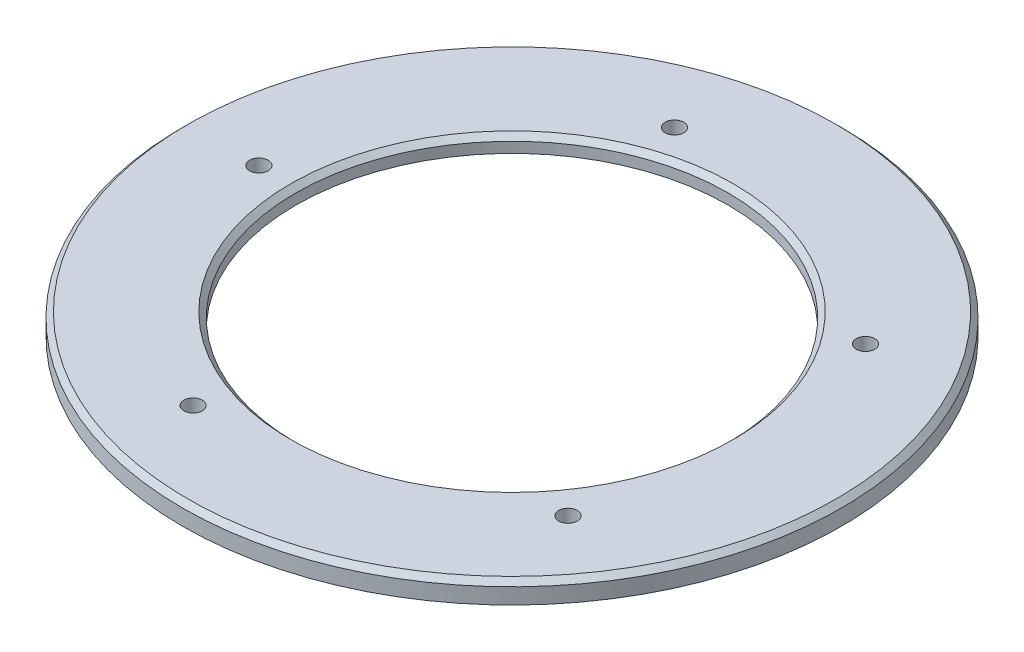
ISO-10303-21;
HEADER;
FILE_DESCRIPTION(('STEP AP214'),'2;1');
FILE_NAME('part.step','',(''),(''),'','','');
FILE_SCHEMA(('AUTOMOTIVE_DESIGN { 1 0 10303 214 1 1 1 1 }'));
ENDSEC;
DATA;
#1=APPLICATION_CONTEXT('core data for automotive mechanical design processes');
#2=APPLICATION_PROTOCOL_DEFINITION('international standard','automotive_design',2000,#1);
#3=PRODUCT_CONTEXT('',#1,'mechanical');
#4=PRODUCT('Part','Part','',(#3));
#5=PRODUCT_RELATED_PRODUCT_CATEGORY('part','',(#4));
#6=PRODUCT_DEFINITION_FORMATION('','',#4);
#7=PRODUCT_DEFINITION_CONTEXT('part definition',#1,'design');
#8=PRODUCT_DEFINITION('design','',#6,#7);
#9=PRODUCT_DEFINITION_SHAPE('','',#8);
#10=(LENGTH_UNIT() NAMED_UNIT(*) SI_UNIT(.MILLI.,.METRE.));
#11=(NAMED_UNIT(*) PLANE_ANGLE_UNIT() SI_UNIT($,.RADIAN.));
#12=(NAMED_UNIT(*) SI_UNIT($,.STERADIAN.) SOLID_ANGLE_UNIT());
#13=UNCERTAINTY_MEASURE_WITH_UNIT(LENGTH_MEASURE(1.E-05),#10,'distance_accuracy_value','');
#14=(GEOMETRIC_REPRESENTATION_CONTEXT(3) GLOBAL_UNCERTAINTY_ASSIGNED_CONTEXT((#13)) GLOBAL_UNIT_ASSIGNED_CONTEXT((#10,
#11,#12)) REPRESENTATION_CONTEXT('',''));
#15=CARTESIAN_POINT('',(0.,0.,0.));
#16=DIRECTION('',(0.,0.,1.));
#17=DIRECTION('',(1.,0.,0.));
#18=AXIS2_PLACEMENT_3D('',#15,#16,#17);
#19=CARTESIAN_POINT('',(-41.,1.,0.));
#20=DIRECTION('',(0.,1.,0.));
#21=DIRECTION('',(0.,0.,1.));
#22=AXIS2_PLACEMENT_3D('',#19,#20,#21);
#23=PLANE('',#22);
#24=CARTESIAN_POINT('',(-48.,1.,0.));
#25=DIRECTION('',(0.,-1.,0.));
#26=DIRECTION('',(0.,0.,-1.));
#27=AXIS2_PLACEMENT_3D('',#24,#25,#26);
#28=CIRCLE('',#27,1.75208573463745);
#29=CARTESIAN_POINT('',(-48.,1.,-1.75208573463745));
#30=VERTEX_POINT('',#29);
#31=EDGE_CURVE('E97',#30,#30,#28,.T.);
#32=ORIENTED_EDGE('',*,*,#31,.F.);
#33=EDGE_LOOP('',(#32));
#34=FACE_BOUND('',#33,.T.);
#35=CARTESIAN_POINT('',(-14.8328157299975,1.,45.6507127821674));
#36=DIRECTION('',(0.,-1.,0.));
#37=DIRECTION('',(0.,0.,-1.));
#38=AXIS2_PLACEMENT_3D('',#35,#36,#37);
#39=CIRCLE('',#38,1.75208573463745);
#40=CARTESIAN_POINT('',(-14.8328157299975,1.,43.8986270475299));
#41=VERTEX_POINT('',#40);
#42=EDGE_CURVE('E94',#41,#41,#39,.T.);
#43=ORIENTED_EDGE('',*,*,#42,.F.);
#44=EDGE_LOOP('',(#43));
#45=FACE_BOUND('',#44,.T.);
#46=CARTESIAN_POINT('',(38.8328157299975,1.,28.2136921100387));
#47=DIRECTION('',(0.,-1.,0.));
#48=DIRECTION('',(0.,0.,-1.));
#49=AXIS2_PLACEMENT_3D('',#46,#47,#48);
#50=CIRCLE('',#49,1.75208573463745);
#51=CARTESIAN_POINT('',(38.8328157299975,1.,26.4616063754013));
#52=VERTEX_POINT('',#51);
#53=EDGE_CURVE('E88',#52,#52,#50,.T.);
#54=ORIENTED_EDGE('',*,*,#53,.F.);
#55=EDGE_LOOP('',(#54));
#56=FACE_BOUND('',#55,.T.);
#57=CARTESIAN_POINT('',(38.8328157299975,1.,-28.2136921100387));
#58=DIRECTION('',(0.,-1.,0.));
#59=DIRECTION('',(0.,0.,-1.));
#60=AXIS2_PLACEMENT_3D('',#57,#58,#59);
#61=CIRCLE('',#60,1.75208573463745);
#62=CARTESIAN_POINT('',(38.8328157299975,1.,-29.9657778446762));
#63=VERTEX_POINT('',#62);
#64=EDGE_CURVE('E82',#63,#63,#61,.T.);
#65=ORIENTED_EDGE('',*,*,#64,.F.);
#66=EDGE_LOOP('',(#65));
#67=FACE_BOUND('',#66,.T.);
#68=CARTESIAN_POINT('',(-14.8328157299975,1.,-45.6507127821674));
#69=DIRECTION('',(0.,-1.,0.));
#70=DIRECTION('',(0.,0.,-1.));
#71=AXIS2_PLACEMENT_3D('',#68,#69,#70);
#72=CIRCLE('',#71,1.75208573463745);
#73=CARTESIAN_POINT('',(-14.8328157299975,1.,-47.4027985168048));
#74=VERTEX_POINT('',#73);
#75=EDGE_CURVE('E76',#74,#74,#72,.T.);
#76=ORIENTED_EDGE('',*,*,#75,.F.);
#77=EDGE_LOOP('',(#76));
#78=FACE_BOUND('',#77,.T.);
#79=CARTESIAN_POINT('',(0.,1.,0.));
#80=DIRECTION('',(0.,-1.,0.));
#81=DIRECTION('',(0.,0.,-1.));
#82=AXIS2_PLACEMENT_3D('',#79,#80,#81);
#83=CIRCLE('',#82,41.);
#84=CARTESIAN_POINT('',(0.,1.,-41.));
#85=VERTEX_POINT('',#84);
#86=EDGE_CURVE('E60',#85,#85,#83,.T.);
#87=ORIENTED_EDGE('',*,*,#86,.F.);
#88=EDGE_LOOP('',(#87));
#89=FACE_BOUND('',#88,.T.);
#90=CARTESIAN_POINT('',(0.,1.,0.));
#91=DIRECTION('',(0.,-1.,0.));
#92=DIRECTION('',(0.,0.,-1.));
#93=AXIS2_PLACEMENT_3D('',#90,#91,#92);
#94=CIRCLE('',#93,55.);
#95=CARTESIAN_POINT('',(0.,1.,-55.));
#96=VERTEX_POINT('',#95);
#97=EDGE_CURVE('E69',#96,#96,#94,.T.);
#98=ORIENTED_EDGE('',*,*,#97,.T.);
#99=EDGE_LOOP('',(#98));
#100=FACE_BOUND('',#99,.T.);
#101=ADVANCED_FACE('F39',(#34,#45,#56,#67,#78,#89,#100),#23,.F.);
#102=CARTESIAN_POINT('',(0.,0.,0.));
#103=DIRECTION('',(0.,-1.,0.));
#104=DIRECTION('',(0.,0.,-1.));
#105=AXIS2_PLACEMENT_3D('',#102,#103,#104);
#106=CYLINDRICAL_SURFACE('',#105,41.);
#107=CARTESIAN_POINT('',(0.,3.00000000000001,0.));
#108=DIRECTION('',(0.,-1.,0.));
#109=DIRECTION('',(0.,0.,-1.));
#110=AXIS2_PLACEMENT_3D('',#107,#108,#109);
#111=CIRCLE('',#110,41.);
#112=CARTESIAN_POINT('',(0.,3.00000000000001,-41.));
#113=VERTEX_POINT('',#112);
#114=EDGE_CURVE('E47',#113,#113,#111,.F.);
#115=ORIENTED_EDGE('',*,*,#114,.T.);
#116=EDGE_LOOP('',(#115));
#117=FACE_BOUND('',#116,.T.);
#118=ORIENTED_EDGE('',*,*,#86,.T.);
#119=EDGE_LOOP('',(#118));
#120=FACE_BOUND('',#119,.T.);
#121=ADVANCED_FACE('F116',(#117,#120),#106,.F.);
#122=CARTESIAN_POINT('',(-62.5,4.,0.));
#123=DIRECTION('',(0.,-1.,0.));
#124=DIRECTION('',(0.,0.,-1.));
#125=AXIS2_PLACEMENT_3D('',#122,#123,#124);
#126=PLANE('',#125);
#127=CARTESIAN_POINT('',(0.,4.,0.));
#128=DIRECTION('',(0.,-1.,0.));
#129=DIRECTION('',(0.,0.,-1.));
#130=AXIS2_PLACEMENT_3D('',#127,#128,#129);
#131=CIRCLE('',#130,42.);
#132=CARTESIAN_POINT('',(0.,4.,-42.));
#133=VERTEX_POINT('',#132);
#134=EDGE_CURVE('E51',#133,#133,#131,.T.);
#135=ORIENTED_EDGE('',*,*,#134,.T.);
#136=EDGE_LOOP('',(#135));
#137=FACE_BOUND('',#136,.T.);
#138=CARTESIAN_POINT('',(0.,4.,0.));
#139=DIRECTION('',(0.,-1.,0.));
#140=DIRECTION('',(0.,0.,-1.));
#141=AXIS2_PLACEMENT_3D('',#138,#139,#140);
#142=CIRCLE('',#141,61.5);
#143=CARTESIAN_POINT('',(0.,4.,-61.5));
#144=VERTEX_POINT('',#143);
#145=EDGE_CURVE('E55',#144,#144,#142,.F.);
#146=ORIENTED_EDGE('',*,*,#145,.T.);
#147=EDGE_LOOP('',(#146));
#148=FACE_BOUND('',#147,.T.);
#149=CARTESIAN_POINT('',(-48.,4.,0.));
#150=DIRECTION('',(0.,-1.,0.));
#151=DIRECTION('',(0.,0.,-1.));
#152=AXIS2_PLACEMENT_3D('',#149,#150,#151);
#153=CIRCLE('',#152,1.75208573463745);
#154=CARTESIAN_POINT('',(-48.,4.,-1.75208573463745));
#155=VERTEX_POINT('',#154);
#156=EDGE_CURVE('E72',#155,#155,#153,.T.);
#157=ORIENTED_EDGE('',*,*,#156,.T.);
#158=EDGE_LOOP('',(#157));
#159=FACE_BOUND('',#158,.T.);
#160=CARTESIAN_POINT('',(-14.8328157299975,4.,45.6507127821674));
#161=DIRECTION('',(0.,-1.,0.));
#162=DIRECTION('',(0.,0.,-1.));
#163=AXIS2_PLACEMENT_3D('',#160,#161,#162);
#164=CIRCLE('',#163,1.75208573463745);
#165=CARTESIAN_POINT('',(-14.8328157299975,4.,43.8986270475299));
#166=VERTEX_POINT('',#165);
#167=EDGE_CURVE('E91',#166,#166,#164,.T.);
#168=ORIENTED_EDGE('',*,*,#167,.T.);
#169=EDGE_LOOP('',(#168));
#170=FACE_BOUND('',#169,.T.);
#171=CARTESIAN_POINT('',(38.8328157299975,4.,28.2136921100387));
#172=DIRECTION('',(0.,-1.,0.));
#173=DIRECTION('',(0.,0.,-1.));
#174=AXIS2_PLACEMENT_3D('',#171,#172,#173);
#175=CIRCLE('',#174,1.75208573463745);
#176=CARTESIAN_POINT('',(38.8328157299975,4.,26.4616063754013));
#177=VERTEX_POINT('',#176);
#178=EDGE_CURVE('E85',#177,#177,#175,.T.);
#179=ORIENTED_EDGE('',*,*,#178,.T.);
#180=EDGE_LOOP('',(#179));
#181=FACE_BOUND('',#180,.T.);
#182=CARTESIAN_POINT('',(38.8328157299975,4.,-28.2136921100387));
#183=DIRECTION('',(0.,-1.,0.));
#184=DIRECTION('',(0.,0.,-1.));
#185=AXIS2_PLACEMENT_3D('',#182,#183,#184);
#186=CIRCLE('',#185,1.75208573463745);
#187=CARTESIAN_POINT('',(38.8328157299975,4.,-29.9657778446762));
#188=VERTEX_POINT('',#187);
#189=EDGE_CURVE('E79',#188,#188,#186,.T.);
#190=ORIENTED_EDGE('',*,*,#189,.T.);
#191=EDGE_LOOP('',(#190));
#192=FACE_BOUND('',#191,.T.);
#193=CARTESIAN_POINT('',(-14.8328157299975,4.,-45.6507127821674));
#194=DIRECTION('',(0.,-1.,0.));
#195=DIRECTION('',(0.,0.,-1.));
#196=AXIS2_PLACEMENT_3D('',#193,#194,#195);
#197=CIRCLE('',#196,1.75208573463745);
#198=CARTESIAN_POINT('',(-14.8328157299975,4.,-47.4027985168048));
#199=VERTEX_POINT('',#198);
#200=EDGE_CURVE('E73',#199,#199,#197,.T.);
#201=ORIENTED_EDGE('',*,*,#200,.T.);
#202=EDGE_LOOP('',(#201));
#203=FACE_BOUND('',#202,.T.);
#204=ADVANCED_FACE('F103',(#137,#148,#159,#170,#181,#192,#203),#126,.F.);
#205=CARTESIAN_POINT('',(0.,0.,0.));
#206=DIRECTION('',(0.,-1.,0.));
#207=DIRECTION('',(0.,0.,-1.));
#208=AXIS2_PLACEMENT_3D('',#205,#206,#207);
#209=CYLINDRICAL_SURFACE('',#208,62.5);
#210=CARTESIAN_POINT('',(0.,3.00000000000001,0.));
#211=DIRECTION('',(0.,-1.,0.));
#212=DIRECTION('',(0.,0.,-1.));
#213=AXIS2_PLACEMENT_3D('',#210,#211,#212);
#214=CIRCLE('',#213,62.5);
#215=CARTESIAN_POINT('',(0.,3.00000000000001,-62.5));
#216=VERTEX_POINT('',#215);
#217=EDGE_CURVE('E10',#216,#216,#214,.T.);
#218=ORIENTED_EDGE('',*,*,#217,.T.);
#219=EDGE_LOOP('',(#218));
#220=FACE_BOUND('',#219,.T.);
#221=CARTESIAN_POINT('',(0.,0.,0.));
#222=DIRECTION('',(0.,-1.,0.));
#223=DIRECTION('',(0.,0.,-1.));
#224=AXIS2_PLACEMENT_3D('',#221,#222,#223);
#225=CIRCLE('',#224,62.5);
#226=CARTESIAN_POINT('',(0.,0.,-62.5));
#227=VERTEX_POINT('',#226);
#228=EDGE_CURVE('E63',#227,#227,#225,.T.);
#229=ORIENTED_EDGE('',*,*,#228,.F.);
#230=EDGE_LOOP('',(#229));
#231=FACE_BOUND('',#230,.T.);
#232=ADVANCED_FACE('F140',(#220,#231),#209,.T.);
#233=CARTESIAN_POINT('',(-55.,0.,0.));
#234=DIRECTION('',(0.,1.,0.));
#235=DIRECTION('',(0.,0.,1.));
#236=AXIS2_PLACEMENT_3D('',#233,#234,#235);
#237=PLANE('',#236);
#238=CARTESIAN_POINT('',(0.,0.,0.));
#239=DIRECTION('',(0.,-1.,0.));
#240=DIRECTION('',(0.,0.,-1.));
#241=AXIS2_PLACEMENT_3D('',#238,#239,#240);
#242=CIRCLE('',#241,55.);
#243=CARTESIAN_POINT('',(0.,0.,-55.));
#244=VERTEX_POINT('',#243);
#245=EDGE_CURVE('E66',#244,#244,#242,.T.);
#246=ORIENTED_EDGE('',*,*,#245,.F.);
#247=EDGE_LOOP('',(#246));
#248=FACE_BOUND('',#247,.T.);
#249=ORIENTED_EDGE('',*,*,#228,.T.);
#250=EDGE_LOOP('',(#249));
#251=FACE_BOUND('',#250,.T.);
#252=ADVANCED_FACE('F134',(#248,#251),#237,.F.);
#253=CARTESIAN_POINT('',(0.,0.,0.));
#254=DIRECTION('',(0.,-1.,0.));
#255=DIRECTION('',(0.,0.,-1.));
#256=AXIS2_PLACEMENT_3D('',#253,#254,#255);
#257=CYLINDRICAL_SURFACE('',#256,55.);
#258=ORIENTED_EDGE('',*,*,#97,.F.);
#259=EDGE_LOOP('',(#258));
#260=FACE_BOUND('',#259,.T.);
#261=ORIENTED_EDGE('',*,*,#245,.T.);
#262=EDGE_LOOP('',(#261));
#263=FACE_BOUND('',#262,.T.);
#264=ADVANCED_FACE('F130',(#260,#263),#257,.F.);
#265=CARTESIAN_POINT('',(-14.8328157299975,4.,-45.6507127821674));
#266=DIRECTION('',(0.,-1.,0.));
#267=DIRECTION('',(0.,0.,-1.));
#268=AXIS2_PLACEMENT_3D('',#265,#266,#267);
#269=CYLINDRICAL_SURFACE('',#268,1.75208573463745);
#270=ORIENTED_EDGE('',*,*,#200,.F.);
#271=EDGE_LOOP('',(#270));
#272=FACE_BOUND('',#271,.T.);
#273=ORIENTED_EDGE('',*,*,#75,.T.);
#274=EDGE_LOOP('',(#273));
#275=FACE_BOUND('',#274,.T.);
#276=ADVANCED_FACE('F133',(#272,#275),#269,.F.);
#277=CARTESIAN_POINT('',(38.8328157299975,4.,-28.2136921100387));
#278=DIRECTION('',(0.,-1.,0.));
#279=DIRECTION('',(0.,0.,-1.));
#280=AXIS2_PLACEMENT_3D('',#277,#278,#279);
#281=CYLINDRICAL_SURFACE('',#280,1.75208573463745);
#282=ORIENTED_EDGE('',*,*,#189,.F.);
#283=EDGE_LOOP('',(#282));
#284=FACE_BOUND('',#283,.T.);
#285=ORIENTED_EDGE('',*,*,#64,.T.);
#286=EDGE_LOOP('',(#285));
#287=FACE_BOUND('',#286,.T.);
#288=ADVANCED_FACE('F199',(#284,#287),#281,.F.);
#289=CARTESIAN_POINT('',(38.8328157299975,4.,28.2136921100387));
#290=DIRECTION('',(0.,-1.,0.));
#291=DIRECTION('',(0.,0.,-1.));
#292=AXIS2_PLACEMENT_3D('',#289,#290,#291);
#293=CYLINDRICAL_SURFACE('',#292,1.75208573463745);
#294=ORIENTED_EDGE('',*,*,#178,.F.);
#295=EDGE_LOOP('',(#294));
#296=FACE_BOUND('',#295,.T.);
#297=ORIENTED_EDGE('',*,*,#53,.T.);
#298=EDGE_LOOP('',(#297));
#299=FACE_BOUND('',#298,.T.);
#300=ADVANCED_FACE('F189',(#296,#299),#293,.F.);
#301=CARTESIAN_POINT('',(-14.8328157299975,4.,45.6507127821674));
#302=DIRECTION('',(0.,-1.,0.));
#303=DIRECTION('',(0.,0.,-1.));
#304=AXIS2_PLACEMENT_3D('',#301,#302,#303);
#305=CYLINDRICAL_SURFACE('',#304,1.75208573463745);
#306=ORIENTED_EDGE('',*,*,#167,.F.);
#307=EDGE_LOOP('',(#306));
#308=FACE_BOUND('',#307,.T.);
#309=ORIENTED_EDGE('',*,*,#42,.T.);
#310=EDGE_LOOP('',(#309));
#311=FACE_BOUND('',#310,.T.);
#312=ADVANCED_FACE('F110',(#308,#311),#305,.F.);
#313=CARTESIAN_POINT('',(-48.,4.,0.));
#314=DIRECTION('',(0.,-1.,0.));
#315=DIRECTION('',(0.,0.,-1.));
#316=AXIS2_PLACEMENT_3D('',#313,#314,#315);
#317=CYLINDRICAL_SURFACE('',#316,1.75208573463745);
#318=ORIENTED_EDGE('',*,*,#156,.F.);
#319=EDGE_LOOP('',(#318));
#320=FACE_BOUND('',#319,.T.);
#321=ORIENTED_EDGE('',*,*,#31,.T.);
#322=EDGE_LOOP('',(#321));
#323=FACE_BOUND('',#322,.T.);
#324=ADVANCED_FACE('F106',(#320,#323),#317,.F.);
#325=CARTESIAN_POINT('',(0.,4.,0.));
#326=DIRECTION('',(0.,1.,0.));
#327=DIRECTION('',(0.,0.,1.));
#328=AXIS2_PLACEMENT_3D('',#325,#326,#327);
#329=CONICAL_SURFACE('',#328,42.,0.785398163397438);
#330=ORIENTED_EDGE('',*,*,#114,.F.);
#331=EDGE_LOOP('',(#330));
#332=FACE_BOUND('',#331,.T.);
#333=ORIENTED_EDGE('',*,*,#134,.F.);
#334=EDGE_LOOP('',(#333));
#335=FACE_BOUND('',#334,.T.);
#336=ADVANCED_FACE('F109',(#332,#335),#329,.F.);
#337=CARTESIAN_POINT('',(0.,3.00000000000001,0.));
#338=DIRECTION('',(0.,-1.,0.));
#339=DIRECTION('',(0.,0.,-1.));
#340=AXIS2_PLACEMENT_3D('',#337,#338,#339);
#341=CONICAL_SURFACE('',#340,62.5,0.785398163397445);
#342=ORIENTED_EDGE('',*,*,#145,.F.);
#343=EDGE_LOOP('',(#342));
#344=FACE_BOUND('',#343,.T.);
#345=ORIENTED_EDGE('',*,*,#217,.F.);
#346=EDGE_LOOP('',(#345));
#347=FACE_BOUND('',#346,.T.);
#348=ADVANCED_FACE('F42',(#344,#347),#341,.T.);
#349=CLOSED_SHELL('',(#101,#121,#204,#232,#252,#264,#276,#288,#300,#312,#324,#336,#348));
#350=MANIFOLD_SOLID_BREP('B2',#349);
#351=ADVANCED_BREP_SHAPE_REPRESENTATION('',(#18,#350),#14);
#352=SHAPE_DEFINITION_REPRESENTATION(#9,#351);
ENDSEC;
END-ISO-10303-21;
